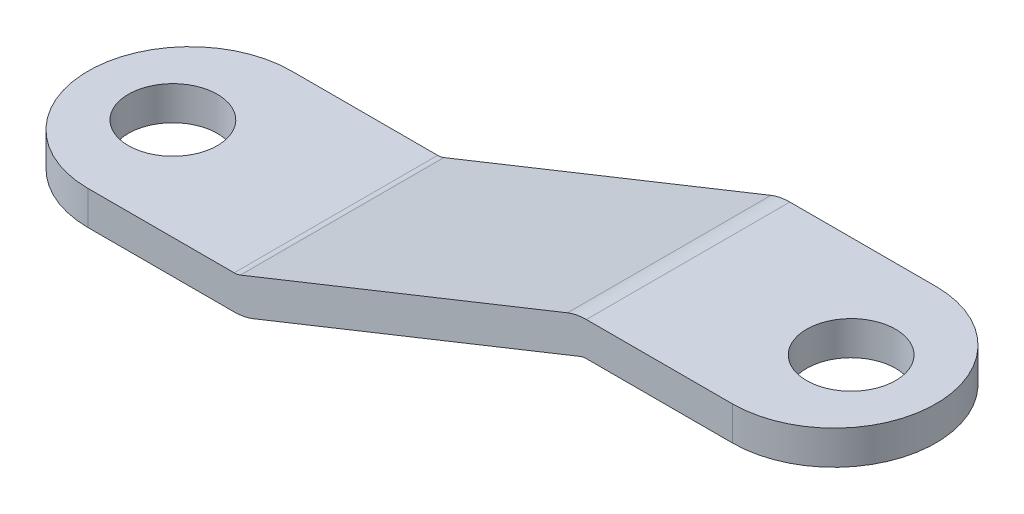
ISO-10303-21;
HEADER;
FILE_DESCRIPTION(('STEP AP214'),'2;1');
FILE_NAME('part.step','',(''),(''),'','','');
FILE_SCHEMA(('AUTOMOTIVE_DESIGN { 1 0 10303 214 1 1 1 1 }'));
ENDSEC;
DATA;
#1=APPLICATION_CONTEXT('core data for automotive mechanical design processes');
#2=APPLICATION_PROTOCOL_DEFINITION('international standard','automotive_design',2000,#1);
#3=PRODUCT_CONTEXT('',#1,'mechanical');
#4=PRODUCT('Part','Part','',(#3));
#5=PRODUCT_RELATED_PRODUCT_CATEGORY('part','',(#4));
#6=PRODUCT_DEFINITION_FORMATION('','',#4);
#7=PRODUCT_DEFINITION_CONTEXT('part definition',#1,'design');
#8=PRODUCT_DEFINITION('design','',#6,#7);
#9=PRODUCT_DEFINITION_SHAPE('','',#8);
#10=(LENGTH_UNIT() NAMED_UNIT(*) SI_UNIT(.MILLI.,.METRE.));
#11=(NAMED_UNIT(*) PLANE_ANGLE_UNIT() SI_UNIT($,.RADIAN.));
#12=(NAMED_UNIT(*) SI_UNIT($,.STERADIAN.) SOLID_ANGLE_UNIT());
#13=UNCERTAINTY_MEASURE_WITH_UNIT(LENGTH_MEASURE(1.E-05),#10,'distance_accuracy_value','');
#14=(GEOMETRIC_REPRESENTATION_CONTEXT(3) GLOBAL_UNCERTAINTY_ASSIGNED_CONTEXT((#13)) GLOBAL_UNIT_ASSIGNED_CONTEXT((#10,
#11,#12)) REPRESENTATION_CONTEXT('',''));
#15=CARTESIAN_POINT('',(0.,0.,0.));
#16=DIRECTION('',(0.,0.,1.));
#17=DIRECTION('',(1.,0.,0.));
#18=AXIS2_PLACEMENT_3D('',#15,#16,#17);
#19=CARTESIAN_POINT('',(28.3081318457076,5.6,4.8));
#20=DIRECTION('',(0.,1.,0.));
#21=DIRECTION('',(0.,0.,1.));
#22=AXIS2_PLACEMENT_3D('',#19,#20,#21);
#23=PLANE('',#22);
#24=DIRECTION('',(1.,0.,0.));
#25=VECTOR('',#24,1.);
#26=CARTESIAN_POINT('',(28.3081318457076,5.6,-4.8));
#27=LINE('',#26,#25);
#28=CARTESIAN_POINT('',(28.3081318457076,5.6,-4.8));
#29=VERTEX_POINT('',#28);
#30=CARTESIAN_POINT('',(35.2,5.6,-4.8));
#31=VERTEX_POINT('',#30);
#32=EDGE_CURVE('E161',#29,#31,#27,.T.);
#33=ORIENTED_EDGE('',*,*,#32,.T.);
#34=CARTESIAN_POINT('',(35.2,5.6,0.));
#35=DIRECTION('',(0.,1.,0.));
#36=DIRECTION('',(0.,0.,1.));
#37=AXIS2_PLACEMENT_3D('',#34,#35,#36);
#38=CIRCLE('',#37,4.8);
#39=CARTESIAN_POINT('',(35.2,5.6,4.8));
#40=VERTEX_POINT('',#39);
#41=EDGE_CURVE('E48',#31,#40,#38,.F.);
#42=ORIENTED_EDGE('',*,*,#41,.T.);
#43=DIRECTION('',(1.,0.,0.));
#44=VECTOR('',#43,1.);
#45=CARTESIAN_POINT('',(28.3081318457076,5.6,4.8));
#46=LINE('',#45,#44);
#47=CARTESIAN_POINT('',(28.3081318457076,5.6,4.8));
#48=VERTEX_POINT('',#47);
#49=EDGE_CURVE('E195',#48,#40,#46,.T.);
#50=ORIENTED_EDGE('',*,*,#49,.F.);
#51=DIRECTION('',(0.,0.,-1.));
#52=VECTOR('',#51,1.);
#53=CARTESIAN_POINT('',(28.3081318457076,5.6,4.8));
#54=LINE('',#53,#52);
#55=EDGE_CURVE('E224',#48,#29,#54,.T.);
#56=ORIENTED_EDGE('',*,*,#55,.T.);
#57=EDGE_LOOP('',(#33,#42,#50,#56));
#58=FACE_BOUND('',#57,.T.);
#59=CARTESIAN_POINT('',(36.,5.6,0.));
#60=DIRECTION('',(0.,1.,0.));
#61=DIRECTION('',(0.,0.,1.));
#62=AXIS2_PLACEMENT_3D('',#59,#60,#61);
#63=CIRCLE('',#62,2.1);
#64=CARTESIAN_POINT('',(36.,5.6,2.1));
#65=VERTEX_POINT('',#64);
#66=EDGE_CURVE('E188',#65,#65,#63,.T.);
#67=ORIENTED_EDGE('',*,*,#66,.T.);
#68=EDGE_LOOP('',(#67));
#69=FACE_BOUND('',#68,.T.);
#70=ADVANCED_FACE('F40',(#58,#69),#23,.F.);
#71=CARTESIAN_POINT('',(28.3081318457076,7.2,4.8));
#72=DIRECTION('',(0.,1.,0.));
#73=DIRECTION('',(0.,0.,1.));
#74=AXIS2_PLACEMENT_3D('',#71,#72,#73);
#75=PLANE('',#74);
#76=CARTESIAN_POINT('',(35.2,7.2,0.));
#77=DIRECTION('',(0.,1.,0.));
#78=DIRECTION('',(0.,0.,1.));
#79=AXIS2_PLACEMENT_3D('',#76,#77,#78);
#80=CIRCLE('',#79,4.8);
#81=CARTESIAN_POINT('',(35.2,7.2,4.8));
#82=VERTEX_POINT('',#81);
#83=CARTESIAN_POINT('',(35.2,7.2,-4.8));
#84=VERTEX_POINT('',#83);
#85=EDGE_CURVE('E11',#82,#84,#80,.T.);
#86=ORIENTED_EDGE('',*,*,#85,.T.);
#87=DIRECTION('',(1.,0.,0.));
#88=VECTOR('',#87,1.);
#89=CARTESIAN_POINT('',(28.3081318457076,7.2,-4.8));
#90=LINE('',#89,#88);
#91=CARTESIAN_POINT('',(28.3081318457076,7.2,-4.8));
#92=VERTEX_POINT('',#91);
#93=EDGE_CURVE('E152',#92,#84,#90,.T.);
#94=ORIENTED_EDGE('',*,*,#93,.F.);
#95=DIRECTION('',(0.,0.,-1.));
#96=VECTOR('',#95,1.);
#97=CARTESIAN_POINT('',(28.3081318457076,7.2,4.8));
#98=LINE('',#97,#96);
#99=CARTESIAN_POINT('',(28.3081318457076,7.2,4.8));
#100=VERTEX_POINT('',#99);
#101=EDGE_CURVE('E134',#100,#92,#98,.T.);
#102=ORIENTED_EDGE('',*,*,#101,.F.);
#103=DIRECTION('',(1.,0.,0.));
#104=VECTOR('',#103,1.);
#105=CARTESIAN_POINT('',(28.3081318457076,7.2,4.8));
#106=LINE('',#105,#104);
#107=EDGE_CURVE('E200',#100,#82,#106,.T.);
#108=ORIENTED_EDGE('',*,*,#107,.T.);
#109=EDGE_LOOP('',(#86,#94,#102,#108));
#110=FACE_BOUND('',#109,.T.);
#111=CARTESIAN_POINT('',(36.,7.2,0.));
#112=DIRECTION('',(0.,1.,0.));
#113=DIRECTION('',(0.,0.,1.));
#114=AXIS2_PLACEMENT_3D('',#111,#112,#113);
#115=CIRCLE('',#114,2.1);
#116=CARTESIAN_POINT('',(36.,7.2,2.1));
#117=VERTEX_POINT('',#116);
#118=EDGE_CURVE('E143',#117,#117,#115,.T.);
#119=ORIENTED_EDGE('',*,*,#118,.F.);
#120=EDGE_LOOP('',(#119));
#121=FACE_BOUND('',#120,.T.);
#122=ADVANCED_FACE('F157',(#110,#121),#75,.T.);
#123=CARTESIAN_POINT('',(28.3081318457076,4.80000000000001,4.8));
#124=DIRECTION('',(0.,0.,-1.));
#125=DIRECTION('',(-1.,0.,0.));
#126=AXIS2_PLACEMENT_3D('',#123,#124,#125);
#127=CYLINDRICAL_SURFACE('',#126,2.4);
#128=ORIENTED_EDGE('',*,*,#101,.T.);
#129=CARTESIAN_POINT('',(28.3081318457076,4.80000000000001,-4.8));
#130=DIRECTION('',(0.,0.,1.));
#131=DIRECTION('',(1.,0.,0.));
#132=AXIS2_PLACEMENT_3D('',#129,#130,#131);
#133=CIRCLE('',#132,2.4);
#134=CARTESIAN_POINT('',(27.4167942224577,7.02834405812462,-4.8));
#135=VERTEX_POINT('',#134);
#136=EDGE_CURVE('E137',#135,#92,#133,.F.);
#137=ORIENTED_EDGE('',*,*,#136,.F.);
#138=DIRECTION('',(0.,0.,-1.));
#139=VECTOR('',#138,1.);
#140=CARTESIAN_POINT('',(27.4167942224577,7.02834405812462,4.8));
#141=LINE('',#140,#139);
#142=CARTESIAN_POINT('',(27.4167942224577,7.02834405812462,4.8));
#143=VERTEX_POINT('',#142);
#144=EDGE_CURVE('E144',#143,#135,#141,.T.);
#145=ORIENTED_EDGE('',*,*,#144,.F.);
#146=CARTESIAN_POINT('',(28.3081318457076,4.80000000000001,4.8));
#147=DIRECTION('',(0.,0.,1.));
#148=DIRECTION('',(1.,0.,0.));
#149=AXIS2_PLACEMENT_3D('',#146,#147,#148);
#150=CIRCLE('',#149,2.4);
#151=EDGE_CURVE('E139',#143,#100,#150,.F.);
#152=ORIENTED_EDGE('',*,*,#151,.T.);
#153=EDGE_LOOP('',(#128,#137,#145,#152));
#154=FACE_BOUND('',#153,.T.);
#155=ADVANCED_FACE('F136',(#154),#127,.T.);
#156=CARTESIAN_POINT('',(11.9889806953757,0.85721864729179,4.8));
#157=DIRECTION('',(-0.371390676354104,0.928476690885259,0.));
#158=DIRECTION('',(-0.928476690885259,-0.371390676354104,0.));
#159=AXIS2_PLACEMENT_3D('',#156,#157,#158);
#160=PLANE('',#159);
#161=ORIENTED_EDGE('',*,*,#144,.T.);
#162=DIRECTION('',(0.928476690885259,0.371390676354104,0.));
#163=VECTOR('',#162,1.);
#164=CARTESIAN_POINT('',(11.9889806953757,0.85721864729179,-4.8));
#165=LINE('',#164,#163);
#166=CARTESIAN_POINT('',(11.9889806953757,0.85721864729179,-4.8));
#167=VERTEX_POINT('',#166);
#168=EDGE_CURVE('E155',#167,#135,#165,.T.);
#169=ORIENTED_EDGE('',*,*,#168,.F.);
#170=DIRECTION('',(0.,0.,-1.));
#171=VECTOR('',#170,1.);
#172=CARTESIAN_POINT('',(11.9889806953757,0.85721864729179,4.8));
#173=LINE('',#172,#171);
#174=CARTESIAN_POINT('',(11.9889806953757,0.85721864729179,4.8));
#175=VERTEX_POINT('',#174);
#176=EDGE_CURVE('E236',#175,#167,#173,.T.);
#177=ORIENTED_EDGE('',*,*,#176,.F.);
#178=DIRECTION('',(0.928476690885259,0.371390676354104,0.));
#179=VECTOR('',#178,1.);
#180=CARTESIAN_POINT('',(11.9889806953757,0.85721864729179,4.8));
#181=LINE('',#180,#179);
#182=EDGE_CURVE('E205',#175,#143,#181,.T.);
#183=ORIENTED_EDGE('',*,*,#182,.T.);
#184=EDGE_LOOP('',(#161,#169,#177,#183));
#185=FACE_BOUND('',#184,.T.);
#186=ADVANCED_FACE('F287',(#185),#160,.T.);
#187=CARTESIAN_POINT('',(11.6918681542924,1.6,4.8));
#188=DIRECTION('',(0.,0.,-1.));
#189=DIRECTION('',(-1.,0.,0.));
#190=AXIS2_PLACEMENT_3D('',#187,#188,#189);
#191=CYLINDRICAL_SURFACE('',#190,0.8);
#192=ORIENTED_EDGE('',*,*,#176,.T.);
#193=CARTESIAN_POINT('',(11.6918681542924,1.6,-4.8));
#194=DIRECTION('',(0.,0.,1.));
#195=DIRECTION('',(1.,0.,0.));
#196=AXIS2_PLACEMENT_3D('',#193,#194,#195);
#197=CIRCLE('',#196,0.8);
#198=CARTESIAN_POINT('',(11.6918681542924,0.799999999999998,-4.8));
#199=VERTEX_POINT('',#198);
#200=EDGE_CURVE('E167',#199,#167,#197,.T.);
#201=ORIENTED_EDGE('',*,*,#200,.F.);
#202=DIRECTION('',(0.,0.,-1.));
#203=VECTOR('',#202,1.);
#204=CARTESIAN_POINT('',(11.6918681542924,0.799999999999998,4.8));
#205=LINE('',#204,#203);
#206=CARTESIAN_POINT('',(11.6918681542924,0.799999999999998,4.8));
#207=VERTEX_POINT('',#206);
#208=EDGE_CURVE('E234',#207,#199,#205,.T.);
#209=ORIENTED_EDGE('',*,*,#208,.F.);
#210=CARTESIAN_POINT('',(11.6918681542924,1.6,4.8));
#211=DIRECTION('',(0.,0.,1.));
#212=DIRECTION('',(1.,0.,0.));
#213=AXIS2_PLACEMENT_3D('',#210,#211,#212);
#214=CIRCLE('',#213,0.8);
#215=EDGE_CURVE('E209',#207,#175,#214,.T.);
#216=ORIENTED_EDGE('',*,*,#215,.T.);
#217=EDGE_LOOP('',(#192,#201,#209,#216));
#218=FACE_BOUND('',#217,.T.);
#219=ADVANCED_FACE('F284',(#218),#191,.F.);
#220=CARTESIAN_POINT('',(0.,0.8,4.8));
#221=DIRECTION('',(0.,1.,0.));
#222=DIRECTION('',(0.,0.,1.));
#223=AXIS2_PLACEMENT_3D('',#220,#221,#222);
#224=PLANE('',#223);
#225=ORIENTED_EDGE('',*,*,#208,.T.);
#226=DIRECTION('',(1.,0.,0.));
#227=VECTOR('',#226,1.);
#228=CARTESIAN_POINT('',(0.,0.8,-4.8));
#229=LINE('',#228,#227);
#230=CARTESIAN_POINT('',(4.8,0.8,-4.8));
#231=VERTEX_POINT('',#230);
#232=EDGE_CURVE('E169',#231,#199,#229,.T.);
#233=ORIENTED_EDGE('',*,*,#232,.F.);
#234=CARTESIAN_POINT('',(4.8,0.8,0.));
#235=DIRECTION('',(0.,1.,0.));
#236=DIRECTION('',(0.,0.,1.));
#237=AXIS2_PLACEMENT_3D('',#234,#235,#236);
#238=CIRCLE('',#237,4.8);
#239=CARTESIAN_POINT('',(4.8,0.8,4.8));
#240=VERTEX_POINT('',#239);
#241=EDGE_CURVE('E242',#231,#240,#238,.T.);
#242=ORIENTED_EDGE('',*,*,#241,.T.);
#243=DIRECTION('',(1.,0.,0.));
#244=VECTOR('',#243,1.);
#245=CARTESIAN_POINT('',(0.,0.8,4.8));
#246=LINE('',#245,#244);
#247=EDGE_CURVE('E212',#240,#207,#246,.T.);
#248=ORIENTED_EDGE('',*,*,#247,.T.);
#249=EDGE_LOOP('',(#225,#233,#242,#248));
#250=FACE_BOUND('',#249,.T.);
#251=CARTESIAN_POINT('',(4.,0.8,0.));
#252=DIRECTION('',(0.,1.,0.));
#253=DIRECTION('',(0.,0.,1.));
#254=AXIS2_PLACEMENT_3D('',#251,#252,#253);
#255=CIRCLE('',#254,2.1);
#256=CARTESIAN_POINT('',(4.,0.8,2.1));
#257=VERTEX_POINT('',#256);
#258=EDGE_CURVE('E191',#257,#257,#255,.T.);
#259=ORIENTED_EDGE('',*,*,#258,.F.);
#260=EDGE_LOOP('',(#259));
#261=FACE_BOUND('',#260,.T.);
#262=ADVANCED_FACE('F279',(#250,#261),#224,.T.);
#263=CARTESIAN_POINT('',(0.,-0.8,4.8));
#264=DIRECTION('',(0.,1.,0.));
#265=DIRECTION('',(0.,0.,1.));
#266=AXIS2_PLACEMENT_3D('',#263,#264,#265);
#267=PLANE('',#266);
#268=DIRECTION('',(1.,0.,0.));
#269=VECTOR('',#268,1.);
#270=CARTESIAN_POINT('',(0.,-0.8,-4.8));
#271=LINE('',#270,#269);
#272=CARTESIAN_POINT('',(4.8,-0.8,-4.8));
#273=VERTEX_POINT('',#272);
#274=CARTESIAN_POINT('',(11.6918681542924,-0.800000000000002,-4.8));
#275=VERTEX_POINT('',#274);
#276=EDGE_CURVE('E171',#273,#275,#271,.T.);
#277=ORIENTED_EDGE('',*,*,#276,.T.);
#278=DIRECTION('',(0.,0.,-1.));
#279=VECTOR('',#278,1.);
#280=CARTESIAN_POINT('',(11.6918681542924,-0.800000000000002,4.8));
#281=LINE('',#280,#279);
#282=CARTESIAN_POINT('',(11.6918681542924,-0.800000000000002,4.8));
#283=VERTEX_POINT('',#282);
#284=EDGE_CURVE('E232',#283,#275,#281,.T.);
#285=ORIENTED_EDGE('',*,*,#284,.F.);
#286=DIRECTION('',(1.,0.,0.));
#287=VECTOR('',#286,1.);
#288=CARTESIAN_POINT('',(0.,-0.8,4.8));
#289=LINE('',#288,#287);
#290=CARTESIAN_POINT('',(4.8,-0.8,4.8));
#291=VERTEX_POINT('',#290);
#292=EDGE_CURVE('E214',#291,#283,#289,.T.);
#293=ORIENTED_EDGE('',*,*,#292,.F.);
#294=CARTESIAN_POINT('',(4.8,-0.8,0.));
#295=DIRECTION('',(0.,1.,0.));
#296=DIRECTION('',(0.,0.,1.));
#297=AXIS2_PLACEMENT_3D('',#294,#295,#296);
#298=CIRCLE('',#297,4.8);
#299=EDGE_CURVE('E246',#291,#273,#298,.F.);
#300=ORIENTED_EDGE('',*,*,#299,.T.);
#301=EDGE_LOOP('',(#277,#285,#293,#300));
#302=FACE_BOUND('',#301,.T.);
#303=CARTESIAN_POINT('',(4.,-0.800000000000002,0.));
#304=DIRECTION('',(0.,1.,0.));
#305=DIRECTION('',(0.,0.,1.));
#306=AXIS2_PLACEMENT_3D('',#303,#304,#305);
#307=CIRCLE('',#306,2.1);
#308=CARTESIAN_POINT('',(4.,-0.800000000000002,2.1));
#309=VERTEX_POINT('',#308);
#310=EDGE_CURVE('E192',#309,#309,#307,.T.);
#311=ORIENTED_EDGE('',*,*,#310,.T.);
#312=EDGE_LOOP('',(#311));
#313=FACE_BOUND('',#312,.T.);
#314=ADVANCED_FACE('F271',(#302,#313),#267,.F.);
#315=CARTESIAN_POINT('',(11.6918681542924,1.6,4.8));
#316=DIRECTION('',(0.,0.,-1.));
#317=DIRECTION('',(-1.,0.,0.));
#318=AXIS2_PLACEMENT_3D('',#315,#316,#317);
#319=CYLINDRICAL_SURFACE('',#318,2.4);
#320=ORIENTED_EDGE('',*,*,#284,.T.);
#321=CARTESIAN_POINT('',(11.6918681542924,1.6,-4.8));
#322=DIRECTION('',(0.,0.,1.));
#323=DIRECTION('',(1.,0.,0.));
#324=AXIS2_PLACEMENT_3D('',#321,#322,#323);
#325=CIRCLE('',#324,2.4);
#326=CARTESIAN_POINT('',(12.5832057775422,-0.628344058124625,-4.8));
#327=VERTEX_POINT('',#326);
#328=EDGE_CURVE('E174',#275,#327,#325,.T.);
#329=ORIENTED_EDGE('',*,*,#328,.T.);
#330=DIRECTION('',(0.,0.,-1.));
#331=VECTOR('',#330,1.);
#332=CARTESIAN_POINT('',(12.5832057775422,-0.628344058124625,4.8));
#333=LINE('',#332,#331);
#334=CARTESIAN_POINT('',(12.5832057775422,-0.628344058124625,4.8));
#335=VERTEX_POINT('',#334);
#336=EDGE_CURVE('E230',#335,#327,#333,.T.);
#337=ORIENTED_EDGE('',*,*,#336,.F.);
#338=CARTESIAN_POINT('',(11.6918681542924,1.6,4.8));
#339=DIRECTION('',(0.,0.,1.));
#340=DIRECTION('',(1.,0.,0.));
#341=AXIS2_PLACEMENT_3D('',#338,#339,#340);
#342=CIRCLE('',#341,2.4);
#343=EDGE_CURVE('E216',#283,#335,#342,.T.);
#344=ORIENTED_EDGE('',*,*,#343,.F.);
#345=EDGE_LOOP('',(#320,#329,#337,#344));
#346=FACE_BOUND('',#345,.T.);
#347=ADVANCED_FACE('F266',(#346),#319,.T.);
#348=CARTESIAN_POINT('',(12.5832057775422,-0.628344058124625,4.8));
#349=DIRECTION('',(-0.371390676354104,0.928476690885259,0.));
#350=DIRECTION('',(-0.928476690885259,-0.371390676354104,0.));
#351=AXIS2_PLACEMENT_3D('',#348,#349,#350);
#352=PLANE('',#351);
#353=ORIENTED_EDGE('',*,*,#336,.T.);
#354=DIRECTION('',(0.928476690885259,0.371390676354104,0.));
#355=VECTOR('',#354,1.);
#356=CARTESIAN_POINT('',(12.5832057775422,-0.628344058124625,-4.8));
#357=LINE('',#356,#355);
#358=CARTESIAN_POINT('',(28.0110193046243,5.54278135270821,-4.8));
#359=VERTEX_POINT('',#358);
#360=EDGE_CURVE('E177',#327,#359,#357,.T.);
#361=ORIENTED_EDGE('',*,*,#360,.T.);
#362=DIRECTION('',(0.,0.,-1.));
#363=VECTOR('',#362,1.);
#364=CARTESIAN_POINT('',(28.0110193046243,5.54278135270821,4.8));
#365=LINE('',#364,#363);
#366=CARTESIAN_POINT('',(28.0110193046243,5.54278135270821,4.8));
#367=VERTEX_POINT('',#366);
#368=EDGE_CURVE('E227',#367,#359,#365,.T.);
#369=ORIENTED_EDGE('',*,*,#368,.F.);
#370=DIRECTION('',(0.928476690885259,0.371390676354104,0.));
#371=VECTOR('',#370,1.);
#372=CARTESIAN_POINT('',(12.5832057775422,-0.628344058124625,4.8));
#373=LINE('',#372,#371);
#374=EDGE_CURVE('E218',#335,#367,#373,.T.);
#375=ORIENTED_EDGE('',*,*,#374,.F.);
#376=EDGE_LOOP('',(#353,#361,#369,#375));
#377=FACE_BOUND('',#376,.T.);
#378=ADVANCED_FACE('F261',(#377),#352,.F.);
#379=CARTESIAN_POINT('',(28.3081318457076,4.80000000000001,4.8));
#380=DIRECTION('',(0.,0.,-1.));
#381=DIRECTION('',(-1.,0.,0.));
#382=AXIS2_PLACEMENT_3D('',#379,#380,#381);
#383=CYLINDRICAL_SURFACE('',#382,0.799999999999998);
#384=ORIENTED_EDGE('',*,*,#368,.T.);
#385=CARTESIAN_POINT('',(28.3081318457076,4.80000000000001,-4.8));
#386=DIRECTION('',(0.,0.,1.));
#387=DIRECTION('',(1.,0.,0.));
#388=AXIS2_PLACEMENT_3D('',#385,#386,#387);
#389=CIRCLE('',#388,0.799999999999998);
#390=EDGE_CURVE('E180',#359,#29,#389,.F.);
#391=ORIENTED_EDGE('',*,*,#390,.T.);
#392=ORIENTED_EDGE('',*,*,#55,.F.);
#393=CARTESIAN_POINT('',(28.3081318457076,4.80000000000001,4.8));
#394=DIRECTION('',(0.,0.,1.));
#395=DIRECTION('',(1.,0.,0.));
#396=AXIS2_PLACEMENT_3D('',#393,#394,#395);
#397=CIRCLE('',#396,0.799999999999998);
#398=EDGE_CURVE('E221',#367,#48,#397,.F.);
#399=ORIENTED_EDGE('',*,*,#398,.F.);
#400=EDGE_LOOP('',(#384,#391,#392,#399));
#401=FACE_BOUND('',#400,.T.);
#402=ADVANCED_FACE('F321',(#401),#383,.F.);
#403=CARTESIAN_POINT('',(28.3081318457076,4.80000000000001,4.8));
#404=DIRECTION('',(0.,0.,1.));
#405=DIRECTION('',(1.,0.,0.));
#406=AXIS2_PLACEMENT_3D('',#403,#404,#405);
#407=PLANE('',#406);
#408=ORIENTED_EDGE('',*,*,#247,.F.);
#409=DIRECTION('',(0.,1.,0.));
#410=VECTOR('',#409,1.);
#411=CARTESIAN_POINT('',(4.8,4.80000000000001,4.8));
#412=LINE('',#411,#410);
#413=EDGE_CURVE('E55',#240,#291,#412,.F.);
#414=ORIENTED_EDGE('',*,*,#413,.T.);
#415=ORIENTED_EDGE('',*,*,#292,.T.);
#416=ORIENTED_EDGE('',*,*,#343,.T.);
#417=ORIENTED_EDGE('',*,*,#374,.T.);
#418=ORIENTED_EDGE('',*,*,#398,.T.);
#419=ORIENTED_EDGE('',*,*,#49,.T.);
#420=DIRECTION('',(0.,-1.,0.));
#421=VECTOR('',#420,1.);
#422=CARTESIAN_POINT('',(35.2,4.80000000000001,4.8));
#423=LINE('',#422,#421);
#424=EDGE_CURVE('E62',#40,#82,#423,.F.);
#425=ORIENTED_EDGE('',*,*,#424,.T.);
#426=ORIENTED_EDGE('',*,*,#107,.F.);
#427=ORIENTED_EDGE('',*,*,#151,.F.);
#428=ORIENTED_EDGE('',*,*,#182,.F.);
#429=ORIENTED_EDGE('',*,*,#215,.F.);
#430=EDGE_LOOP('',(#408,#414,#415,#416,#417,#418,#419,#425,#426,#427,#428,#429));
#431=FACE_BOUND('',#430,.T.);
#432=ADVANCED_FACE('F252',(#431),#407,.T.);
#433=CARTESIAN_POINT('',(4.,-0.800000000000002,0.));
#434=DIRECTION('',(0.,1.,0.));
#435=DIRECTION('',(0.,0.,1.));
#436=AXIS2_PLACEMENT_3D('',#433,#434,#435);
#437=CYLINDRICAL_SURFACE('',#436,2.1);
#438=ORIENTED_EDGE('',*,*,#258,.T.);
#439=EDGE_LOOP('',(#438));
#440=FACE_BOUND('',#439,.T.);
#441=ORIENTED_EDGE('',*,*,#310,.F.);
#442=EDGE_LOOP('',(#441));
#443=FACE_BOUND('',#442,.T.);
#444=ADVANCED_FACE('F308',(#440,#443),#437,.F.);
#445=CARTESIAN_POINT('',(36.,-0.800000000000002,0.));
#446=DIRECTION('',(0.,1.,0.));
#447=DIRECTION('',(0.,0.,1.));
#448=AXIS2_PLACEMENT_3D('',#445,#446,#447);
#449=CYLINDRICAL_SURFACE('',#448,2.1);
#450=ORIENTED_EDGE('',*,*,#118,.T.);
#451=EDGE_LOOP('',(#450));
#452=FACE_BOUND('',#451,.T.);
#453=ORIENTED_EDGE('',*,*,#66,.F.);
#454=EDGE_LOOP('',(#453));
#455=FACE_BOUND('',#454,.T.);
#456=ADVANCED_FACE('F303',(#452,#455),#449,.F.);
#457=CARTESIAN_POINT('',(4.8,-0.8,0.));
#458=DIRECTION('',(0.,1.,0.));
#459=DIRECTION('',(0.,0.,1.));
#460=AXIS2_PLACEMENT_3D('',#457,#458,#459);
#461=CYLINDRICAL_SURFACE('',#460,4.8);
#462=ORIENTED_EDGE('',*,*,#299,.F.);
#463=ORIENTED_EDGE('',*,*,#413,.F.);
#464=ORIENTED_EDGE('',*,*,#241,.F.);
#465=DIRECTION('',(0.,1.,0.));
#466=VECTOR('',#465,1.);
#467=CARTESIAN_POINT('',(4.8,4.80000000000001,-4.8));
#468=LINE('',#467,#466);
#469=EDGE_CURVE('E185',#231,#273,#468,.F.);
#470=ORIENTED_EDGE('',*,*,#469,.T.);
#471=EDGE_LOOP('',(#462,#463,#464,#470));
#472=FACE_BOUND('',#471,.T.);
#473=ADVANCED_FACE('F275',(#472),#461,.T.);
#474=CARTESIAN_POINT('',(35.2,7.2,0.));
#475=DIRECTION('',(0.,-1.,0.));
#476=DIRECTION('',(0.,0.,-1.));
#477=AXIS2_PLACEMENT_3D('',#474,#475,#476);
#478=CYLINDRICAL_SURFACE('',#477,4.8);
#479=ORIENTED_EDGE('',*,*,#85,.F.);
#480=ORIENTED_EDGE('',*,*,#424,.F.);
#481=ORIENTED_EDGE('',*,*,#41,.F.);
#482=DIRECTION('',(0.,-1.,0.));
#483=VECTOR('',#482,1.);
#484=CARTESIAN_POINT('',(35.2,4.80000000000001,-4.8));
#485=LINE('',#484,#483);
#486=EDGE_CURVE('E183',#31,#84,#485,.F.);
#487=ORIENTED_EDGE('',*,*,#486,.T.);
#488=EDGE_LOOP('',(#479,#480,#481,#487));
#489=FACE_BOUND('',#488,.T.);
#490=ADVANCED_FACE('F42',(#489),#478,.T.);
#491=CARTESIAN_POINT('',(28.3081318457076,4.80000000000001,-4.8));
#492=DIRECTION('',(0.,0.,-1.));
#493=DIRECTION('',(1.,0.,0.));
#494=AXIS2_PLACEMENT_3D('',#491,#492,#493);
#495=PLANE('',#494);
#496=ORIENTED_EDGE('',*,*,#232,.T.);
#497=ORIENTED_EDGE('',*,*,#200,.T.);
#498=ORIENTED_EDGE('',*,*,#168,.T.);
#499=ORIENTED_EDGE('',*,*,#136,.T.);
#500=ORIENTED_EDGE('',*,*,#93,.T.);
#501=ORIENTED_EDGE('',*,*,#486,.F.);
#502=ORIENTED_EDGE('',*,*,#32,.F.);
#503=ORIENTED_EDGE('',*,*,#390,.F.);
#504=ORIENTED_EDGE('',*,*,#360,.F.);
#505=ORIENTED_EDGE('',*,*,#328,.F.);
#506=ORIENTED_EDGE('',*,*,#276,.F.);
#507=ORIENTED_EDGE('',*,*,#469,.F.);
#508=EDGE_LOOP('',(#496,#497,#498,#499,#500,#501,#502,#503,#504,#505,#506,#507));
#509=FACE_BOUND('',#508,.T.);
#510=ADVANCED_FACE('F150',(#509),#495,.T.);
#511=CLOSED_SHELL('',(#70,#122,#155,#186,#219,#262,#314,#347,#378,#402,#432,#444,#456,#473,#490,#510));
#512=MANIFOLD_SOLID_BREP('B2',#511);
#513=ADVANCED_BREP_SHAPE_REPRESENTATION('',(#18,#512),#14);
#514=SHAPE_DEFINITION_REPRESENTATION(#9,#513);
ENDSEC;
END-ISO-10303-21;
